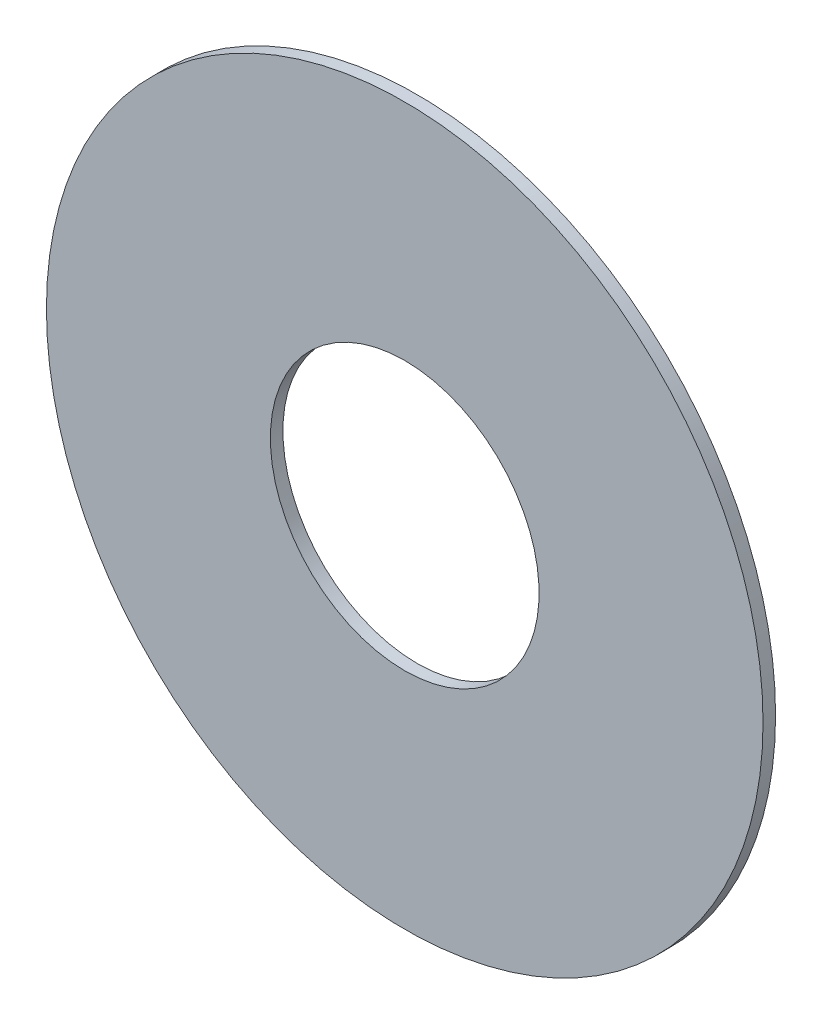
ISO-10303-21;
HEADER;
FILE_DESCRIPTION(('STEP AP214'),'2;1');
FILE_NAME('part.step','',(''),(''),'','','');
FILE_SCHEMA(('AUTOMOTIVE_DESIGN { 1 0 10303 214 1 1 1 1 }'));
ENDSEC;
DATA;
#1=APPLICATION_CONTEXT('core data for automotive mechanical design processes');
#2=APPLICATION_PROTOCOL_DEFINITION('international standard','automotive_design',2000,#1);
#3=PRODUCT_CONTEXT('',#1,'mechanical');
#4=PRODUCT('Part','Part','',(#3));
#5=PRODUCT_RELATED_PRODUCT_CATEGORY('part','',(#4));
#6=PRODUCT_DEFINITION_FORMATION('','',#4);
#7=PRODUCT_DEFINITION_CONTEXT('part definition',#1,'design');
#8=PRODUCT_DEFINITION('design','',#6,#7);
#9=PRODUCT_DEFINITION_SHAPE('','',#8);
#10=(LENGTH_UNIT() NAMED_UNIT(*) SI_UNIT(.MILLI.,.METRE.));
#11=(NAMED_UNIT(*) PLANE_ANGLE_UNIT() SI_UNIT($,.RADIAN.));
#12=(NAMED_UNIT(*) SI_UNIT($,.STERADIAN.) SOLID_ANGLE_UNIT());
#13=UNCERTAINTY_MEASURE_WITH_UNIT(LENGTH_MEASURE(1.E-05),#10,'distance_accuracy_value','');
#14=(GEOMETRIC_REPRESENTATION_CONTEXT(3) GLOBAL_UNCERTAINTY_ASSIGNED_CONTEXT((#13)) GLOBAL_UNIT_ASSIGNED_CONTEXT((#10,
#11,#12)) REPRESENTATION_CONTEXT('',''));
#15=CARTESIAN_POINT('',(0.,0.,0.));
#16=DIRECTION('',(0.,0.,1.));
#17=DIRECTION('',(1.,0.,0.));
#18=AXIS2_PLACEMENT_3D('',#15,#16,#17);
#19=CARTESIAN_POINT('',(143.764,-73.152,-0.045));
#20=DIRECTION('',(0.,0.,-1.));
#21=DIRECTION('',(0.,-1.,0.));
#22=AXIS2_PLACEMENT_3D('',#19,#20,#21);
#23=CYLINDRICAL_SURFACE('',#22,0.375);
#24=CARTESIAN_POINT('',(143.764,-73.152,1.67));
#25=DIRECTION('',(0.,0.,-1.));
#26=DIRECTION('',(0.,-1.,0.));
#27=AXIS2_PLACEMENT_3D('',#24,#25,#26);
#28=CIRCLE('',#27,0.375);
#29=CARTESIAN_POINT('',(143.764,-73.527,1.67));
#30=VERTEX_POINT('',#29);
#31=EDGE_CURVE('E20',#30,#30,#28,.T.);
#32=ORIENTED_EDGE('',*,*,#31,.T.);
#33=DIRECTION('',(0.,0.,1.));
#34=VECTOR('',#33,1.);
#35=CARTESIAN_POINT('',(143.764,-73.527,-0.045));
#36=LINE('',#35,#34);
#37=CARTESIAN_POINT('',(143.764,-73.527,1.705));
#38=VERTEX_POINT('',#37);
#39=EDGE_CURVE('E11',#30,#38,#36,.T.);
#40=ORIENTED_EDGE('',*,*,#39,.T.);
#41=CARTESIAN_POINT('',(143.764,-73.152,1.705));
#42=DIRECTION('',(0.,0.,-1.));
#43=DIRECTION('',(0.,-1.,0.));
#44=AXIS2_PLACEMENT_3D('',#41,#42,#43);
#45=CIRCLE('',#44,0.375);
#46=EDGE_CURVE('E68',#38,#38,#45,.T.);
#47=ORIENTED_EDGE('',*,*,#46,.F.);
#48=ORIENTED_EDGE('',*,*,#39,.F.);
#49=EDGE_LOOP('',(#32,#40,#47,#48));
#50=FACE_BOUND('',#49,.T.);
#51=ADVANCED_FACE('F17',(#50),#23,.F.);
#52=CARTESIAN_POINT('',(143.764,-73.152,1.67));
#53=DIRECTION('',(0.,0.,1.));
#54=DIRECTION('',(1.,0.,0.));
#55=AXIS2_PLACEMENT_3D('',#52,#53,#54);
#56=PLANE('',#55);
#57=ORIENTED_EDGE('',*,*,#31,.F.);
#58=EDGE_LOOP('',(#57));
#59=FACE_BOUND('',#58,.T.);
#60=CARTESIAN_POINT('',(143.764,-73.152,1.67));
#61=DIRECTION('',(0.,0.,1.));
#62=DIRECTION('',(1.,0.,0.));
#63=AXIS2_PLACEMENT_3D('',#60,#61,#62);
#64=CIRCLE('',#63,1.);
#65=CARTESIAN_POINT('',(144.764,-73.152,1.67));
#66=VERTEX_POINT('',#65);
#67=EDGE_CURVE('E55',#66,#66,#64,.T.);
#68=ORIENTED_EDGE('',*,*,#67,.F.);
#69=EDGE_LOOP('',(#68));
#70=FACE_BOUND('',#69,.T.);
#71=ADVANCED_FACE('F78',(#59,#70),#56,.F.);
#72=CARTESIAN_POINT('',(143.764,-73.152,1.705));
#73=DIRECTION('',(0.,0.,1.));
#74=DIRECTION('',(1.,0.,0.));
#75=AXIS2_PLACEMENT_3D('',#72,#73,#74);
#76=PLANE('',#75);
#77=ORIENTED_EDGE('',*,*,#46,.T.);
#78=EDGE_LOOP('',(#77));
#79=FACE_BOUND('',#78,.T.);
#80=CARTESIAN_POINT('',(143.764,-73.152,1.705));
#81=DIRECTION('',(0.,0.,1.));
#82=DIRECTION('',(1.,0.,0.));
#83=AXIS2_PLACEMENT_3D('',#80,#81,#82);
#84=CIRCLE('',#83,1.);
#85=CARTESIAN_POINT('',(144.764,-73.152,1.705));
#86=VERTEX_POINT('',#85);
#87=EDGE_CURVE('E53',#86,#86,#84,.T.);
#88=ORIENTED_EDGE('',*,*,#87,.T.);
#89=EDGE_LOOP('',(#88));
#90=FACE_BOUND('',#89,.T.);
#91=ADVANCED_FACE('F59',(#79,#90),#76,.T.);
#92=CARTESIAN_POINT('',(143.764,-73.152,1.67));
#93=DIRECTION('',(0.,0.,1.));
#94=DIRECTION('',(1.,0.,0.));
#95=AXIS2_PLACEMENT_3D('',#92,#93,#94);
#96=CYLINDRICAL_SURFACE('',#95,1.);
#97=ORIENTED_EDGE('',*,*,#87,.F.);
#98=DIRECTION('',(0.,0.,1.));
#99=VECTOR('',#98,1.);
#100=CARTESIAN_POINT('',(144.764,-73.152,1.67));
#101=LINE('',#100,#99);
#102=EDGE_CURVE('E50',#66,#86,#101,.T.);
#103=ORIENTED_EDGE('',*,*,#102,.F.);
#104=ORIENTED_EDGE('',*,*,#67,.T.);
#105=ORIENTED_EDGE('',*,*,#102,.T.);
#106=EDGE_LOOP('',(#97,#103,#104,#105));
#107=FACE_BOUND('',#106,.T.);
#108=ADVANCED_FACE('F52',(#107),#96,.T.);
#109=CLOSED_SHELL('',(#51,#71,#91,#108));
#110=MANIFOLD_SOLID_BREP('B1',#109);
#111=ADVANCED_BREP_SHAPE_REPRESENTATION('',(#18,#110),#14);
#112=SHAPE_DEFINITION_REPRESENTATION(#9,#111);
ENDSEC;
END-ISO-10303-21;
